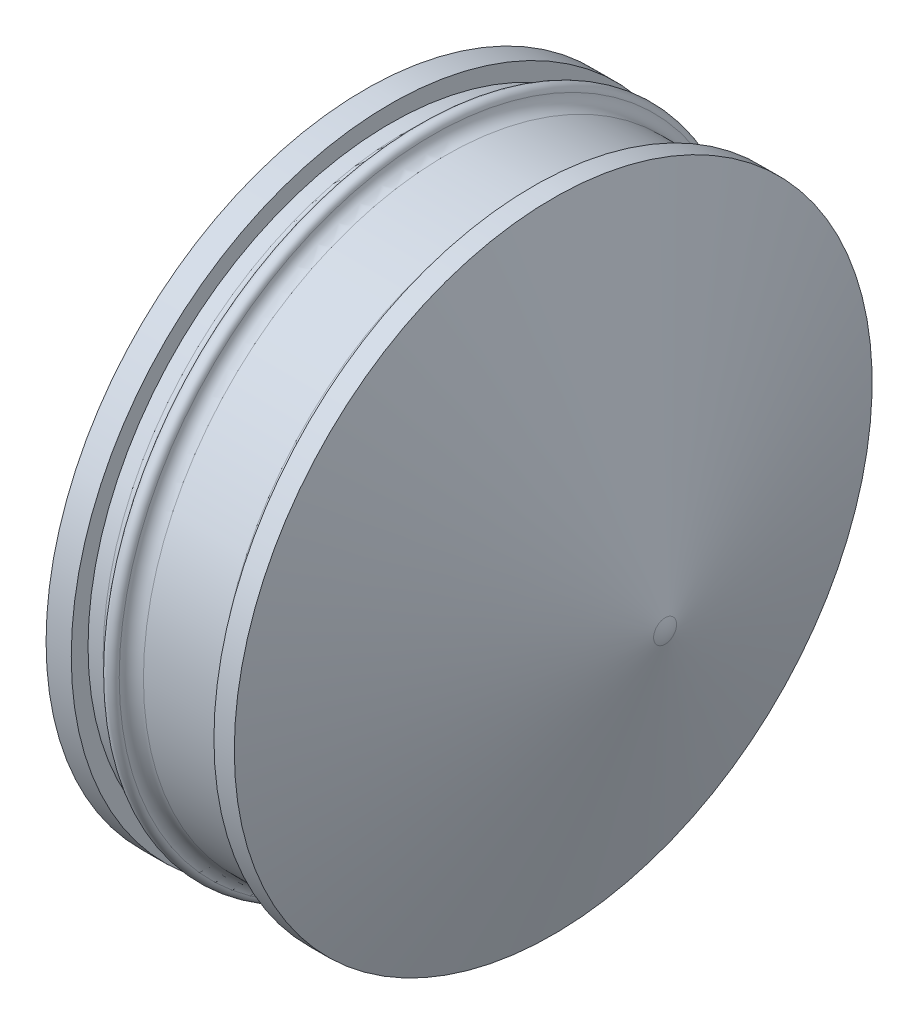
ISO-10303-21;
HEADER;
FILE_DESCRIPTION(('STEP AP214'),'2;1');
FILE_NAME('part.step','',(''),(''),'','','');
FILE_SCHEMA(('AUTOMOTIVE_DESIGN { 1 0 10303 214 1 1 1 1 }'));
ENDSEC;
DATA;
#1=APPLICATION_CONTEXT('core data for automotive mechanical design processes');
#2=APPLICATION_PROTOCOL_DEFINITION('international standard','automotive_design',2000,#1);
#3=PRODUCT_CONTEXT('',#1,'mechanical');
#4=PRODUCT('Part','Part','',(#3));
#5=PRODUCT_RELATED_PRODUCT_CATEGORY('part','',(#4));
#6=PRODUCT_DEFINITION_FORMATION('','',#4);
#7=PRODUCT_DEFINITION_CONTEXT('part definition',#1,'design');
#8=PRODUCT_DEFINITION('design','',#6,#7);
#9=PRODUCT_DEFINITION_SHAPE('','',#8);
#10=(LENGTH_UNIT() NAMED_UNIT(*) SI_UNIT(.MILLI.,.METRE.));
#11=(NAMED_UNIT(*) PLANE_ANGLE_UNIT() SI_UNIT($,.RADIAN.));
#12=(NAMED_UNIT(*) SI_UNIT($,.STERADIAN.) SOLID_ANGLE_UNIT());
#13=UNCERTAINTY_MEASURE_WITH_UNIT(LENGTH_MEASURE(1.E-05),#10,'distance_accuracy_value','');
#14=(GEOMETRIC_REPRESENTATION_CONTEXT(3) GLOBAL_UNCERTAINTY_ASSIGNED_CONTEXT((#13)) GLOBAL_UNIT_ASSIGNED_CONTEXT((#10,
#11,#12)) REPRESENTATION_CONTEXT('',''));
#15=CARTESIAN_POINT('',(0.,0.,0.));
#16=DIRECTION('',(0.,0.,1.));
#17=DIRECTION('',(1.,0.,0.));
#18=AXIS2_PLACEMENT_3D('',#15,#16,#17);
#19=CARTESIAN_POINT('',(-0.699583002099213,0.,0.));
#20=DIRECTION('',(-1.,0.,0.));
#21=DIRECTION('',(0.,0.,1.));
#22=AXIS2_PLACEMENT_3D('',#19,#20,#21);
#23=CYLINDRICAL_SURFACE('',#22,11.43);
#24=CARTESIAN_POINT('',(0.9525,0.,0.));
#25=DIRECTION('',(-1.,0.,0.));
#26=DIRECTION('',(0.,0.,1.));
#27=AXIS2_PLACEMENT_3D('',#24,#25,#26);
#28=CIRCLE('',#27,11.43);
#29=CARTESIAN_POINT('',(0.9525,0.,11.43));
#30=VERTEX_POINT('',#29);
#31=EDGE_CURVE('E11',#30,#30,#28,.T.);
#32=ORIENTED_EDGE('',*,*,#31,.F.);
#33=EDGE_LOOP('',(#32));
#34=FACE_BOUND('',#33,.T.);
#35=CARTESIAN_POINT('',(1.524,0.,0.));
#36=DIRECTION('',(-1.,0.,0.));
#37=DIRECTION('',(0.,0.,1.));
#38=AXIS2_PLACEMENT_3D('',#35,#36,#37);
#39=CIRCLE('',#38,11.43);
#40=CARTESIAN_POINT('',(1.524,0.,11.43));
#41=VERTEX_POINT('',#40);
#42=EDGE_CURVE('E69',#41,#41,#39,.T.);
#43=ORIENTED_EDGE('',*,*,#42,.T.);
#44=EDGE_LOOP('',(#43));
#45=FACE_BOUND('',#44,.T.);
#46=ADVANCED_FACE('F32',(#34,#45),#23,.T.);
#47=CARTESIAN_POINT('',(0.9525,12.065,0.));
#48=DIRECTION('',(-1.,0.,0.));
#49=DIRECTION('',(0.,0.,1.));
#50=AXIS2_PLACEMENT_3D('',#47,#48,#49);
#51=PLANE('',#50);
#52=CARTESIAN_POINT('',(0.9525,0.,0.));
#53=DIRECTION('',(-1.,0.,0.));
#54=DIRECTION('',(0.,0.,1.));
#55=AXIS2_PLACEMENT_3D('',#52,#53,#54);
#56=CIRCLE('',#55,12.065);
#57=CARTESIAN_POINT('',(0.9525,0.,12.065));
#58=VERTEX_POINT('',#57);
#59=EDGE_CURVE('E38',#58,#58,#56,.T.);
#60=ORIENTED_EDGE('',*,*,#59,.F.);
#61=EDGE_LOOP('',(#60));
#62=FACE_BOUND('',#61,.T.);
#63=ORIENTED_EDGE('',*,*,#31,.T.);
#64=EDGE_LOOP('',(#63));
#65=FACE_BOUND('',#64,.T.);
#66=ADVANCED_FACE('F58',(#62,#65),#51,.F.);
#67=CARTESIAN_POINT('',(-0.699583002099213,0.,0.));
#68=DIRECTION('',(-1.,0.,0.));
#69=DIRECTION('',(0.,0.,1.));
#70=AXIS2_PLACEMENT_3D('',#67,#68,#69);
#71=CYLINDRICAL_SURFACE('',#70,12.065);
#72=CARTESIAN_POINT('',(0.,0.,0.));
#73=DIRECTION('',(-1.,0.,0.));
#74=DIRECTION('',(0.,0.,1.));
#75=AXIS2_PLACEMENT_3D('',#72,#73,#74);
#76=CIRCLE('',#75,12.065);
#77=CARTESIAN_POINT('',(0.,0.,12.065));
#78=VERTEX_POINT('',#77);
#79=EDGE_CURVE('E102',#78,#78,#76,.T.);
#80=ORIENTED_EDGE('',*,*,#79,.F.);
#81=EDGE_LOOP('',(#80));
#82=FACE_BOUND('',#81,.T.);
#83=ORIENTED_EDGE('',*,*,#59,.T.);
#84=EDGE_LOOP('',(#83));
#85=FACE_BOUND('',#84,.T.);
#86=ADVANCED_FACE('F63',(#82,#85),#71,.T.);
#87=CARTESIAN_POINT('',(0.,12.065,0.));
#88=DIRECTION('',(1.,0.,0.));
#89=DIRECTION('',(0.,0.,-1.));
#90=AXIS2_PLACEMENT_3D('',#87,#88,#89);
#91=PLANE('',#90);
#92=CARTESIAN_POINT('',(0.,0.,0.));
#93=DIRECTION('',(-1.,0.,0.));
#94=DIRECTION('',(0.,0.,1.));
#95=AXIS2_PLACEMENT_3D('',#92,#93,#94);
#96=CIRCLE('',#95,7.62);
#97=CARTESIAN_POINT('',(0.,0.,7.62));
#98=VERTEX_POINT('',#97);
#99=EDGE_CURVE('E165',#98,#98,#96,.T.);
#100=ORIENTED_EDGE('',*,*,#99,.F.);
#101=EDGE_LOOP('',(#100));
#102=FACE_BOUND('',#101,.T.);
#103=ORIENTED_EDGE('',*,*,#79,.T.);
#104=EDGE_LOOP('',(#103));
#105=FACE_BOUND('',#104,.T.);
#106=ADVANCED_FACE('F109',(#102,#105),#91,.F.);
#107=CARTESIAN_POINT('',(10.16,0.,0.));
#108=DIRECTION('',(-1.,0.,0.));
#109=DIRECTION('',(0.,1.,0.));
#110=AXIS2_PLACEMENT_3D('',#107,#108,#109);
#111=SPHERICAL_SURFACE('',#110,1.27);
#112=CARTESIAN_POINT('',(11.3534096283981,0.,0.));
#113=DIRECTION('',(-1.,0.,0.));
#114=DIRECTION('',(0.,0.,1.));
#115=AXIS2_PLACEMENT_3D('',#112,#113,#114);
#116=CIRCLE('',#115,0.434365582023598);
#117=CARTESIAN_POINT('',(11.3534096283981,0.,0.434365582023598));
#118=VERTEX_POINT('',#117);
#119=EDGE_CURVE('E99',#118,#118,#116,.T.);
#120=ORIENTED_EDGE('',*,*,#119,.F.);
#121=EDGE_LOOP('',(#120));
#122=FACE_BOUND('',#121,.T.);
#123=ADVANCED_FACE('F115',(#122),#111,.T.);
#124=CARTESIAN_POINT('',(11.3534096283981,0.,0.));
#125=DIRECTION('',(-1.,0.,0.));
#126=DIRECTION('',(0.,0.,1.));
#127=AXIS2_PLACEMENT_3D('',#124,#125,#126);
#128=CONICAL_SURFACE('',#127,0.434365582023598,1.22173047639603);
#129=CARTESIAN_POINT('',(7.12020489462271,0.,0.));
#130=DIRECTION('',(-1.,0.,0.));
#131=DIRECTION('',(0.,0.,1.));
#132=AXIS2_PLACEMENT_3D('',#129,#130,#131);
#133=CIRCLE('',#132,12.065);
#134=CARTESIAN_POINT('',(7.12020489462271,0.,12.065));
#135=VERTEX_POINT('',#134);
#136=EDGE_CURVE('E96',#135,#135,#133,.T.);
#137=ORIENTED_EDGE('',*,*,#136,.F.);
#138=EDGE_LOOP('',(#137));
#139=FACE_BOUND('',#138,.T.);
#140=ORIENTED_EDGE('',*,*,#119,.T.);
#141=EDGE_LOOP('',(#140));
#142=FACE_BOUND('',#141,.T.);
#143=ADVANCED_FACE('F122',(#139,#142),#128,.T.);
#144=CARTESIAN_POINT('',(-0.699583002099213,0.,0.));
#145=DIRECTION('',(-1.,0.,0.));
#146=DIRECTION('',(0.,0.,1.));
#147=AXIS2_PLACEMENT_3D('',#144,#145,#146);
#148=CYLINDRICAL_SURFACE('',#147,12.065);
#149=CARTESIAN_POINT('',(6.35,0.,0.));
#150=DIRECTION('',(-1.,0.,0.));
#151=DIRECTION('',(0.,0.,1.));
#152=AXIS2_PLACEMENT_3D('',#149,#150,#151);
#153=CIRCLE('',#152,12.065);
#154=CARTESIAN_POINT('',(6.35,0.,12.065));
#155=VERTEX_POINT('',#154);
#156=EDGE_CURVE('E93',#155,#155,#153,.T.);
#157=ORIENTED_EDGE('',*,*,#156,.F.);
#158=EDGE_LOOP('',(#157));
#159=FACE_BOUND('',#158,.T.);
#160=ORIENTED_EDGE('',*,*,#136,.T.);
#161=EDGE_LOOP('',(#160));
#162=FACE_BOUND('',#161,.T.);
#163=ADVANCED_FACE('F126',(#159,#162),#148,.T.);
#164=CARTESIAN_POINT('',(6.35,11.938,0.));
#165=DIRECTION('',(1.,0.,0.));
#166=DIRECTION('',(0.,0.,-1.));
#167=AXIS2_PLACEMENT_3D('',#164,#165,#166);
#168=PLANE('',#167);
#169=CARTESIAN_POINT('',(6.35,0.,0.));
#170=DIRECTION('',(-1.,0.,0.));
#171=DIRECTION('',(0.,0.,1.));
#172=AXIS2_PLACEMENT_3D('',#169,#170,#171);
#173=CIRCLE('',#172,11.938);
#174=CARTESIAN_POINT('',(6.35,0.,11.938));
#175=VERTEX_POINT('',#174);
#176=EDGE_CURVE('E90',#175,#175,#173,.T.);
#177=ORIENTED_EDGE('',*,*,#176,.F.);
#178=EDGE_LOOP('',(#177));
#179=FACE_BOUND('',#178,.T.);
#180=ORIENTED_EDGE('',*,*,#156,.T.);
#181=EDGE_LOOP('',(#180));
#182=FACE_BOUND('',#181,.T.);
#183=ADVANCED_FACE('F130',(#179,#182),#168,.F.);
#184=CARTESIAN_POINT('',(5.842,0.,0.));
#185=DIRECTION('',(-1.,0.,0.));
#186=DIRECTION('',(0.,0.,1.));
#187=AXIS2_PLACEMENT_3D('',#184,#185,#186);
#188=TOROIDAL_SURFACE('',#187,11.938,0.508);
#189=CARTESIAN_POINT('',(5.842,0.,0.));
#190=DIRECTION('',(-1.,0.,0.));
#191=DIRECTION('',(0.,0.,1.));
#192=AXIS2_PLACEMENT_3D('',#189,#190,#191);
#193=CIRCLE('',#192,11.43);
#194=CARTESIAN_POINT('',(5.842,0.,11.43));
#195=VERTEX_POINT('',#194);
#196=EDGE_CURVE('E87',#195,#195,#193,.T.);
#197=ORIENTED_EDGE('',*,*,#196,.F.);
#198=EDGE_LOOP('',(#197));
#199=FACE_BOUND('',#198,.T.);
#200=ORIENTED_EDGE('',*,*,#176,.T.);
#201=EDGE_LOOP('',(#200));
#202=FACE_BOUND('',#201,.T.);
#203=ADVANCED_FACE('F134',(#199,#202),#188,.F.);
#204=CARTESIAN_POINT('',(-0.699583002099213,0.,0.));
#205=DIRECTION('',(-1.,0.,0.));
#206=DIRECTION('',(0.,0.,1.));
#207=AXIS2_PLACEMENT_3D('',#204,#205,#206);
#208=CYLINDRICAL_SURFACE('',#207,11.43);
#209=CARTESIAN_POINT('',(3.048,0.,0.));
#210=DIRECTION('',(-1.,0.,0.));
#211=DIRECTION('',(0.,0.,1.));
#212=AXIS2_PLACEMENT_3D('',#209,#210,#211);
#213=CIRCLE('',#212,11.43);
#214=CARTESIAN_POINT('',(3.048,0.,11.43));
#215=VERTEX_POINT('',#214);
#216=EDGE_CURVE('E84',#215,#215,#213,.T.);
#217=ORIENTED_EDGE('',*,*,#216,.F.);
#218=EDGE_LOOP('',(#217));
#219=FACE_BOUND('',#218,.T.);
#220=ORIENTED_EDGE('',*,*,#196,.T.);
#221=EDGE_LOOP('',(#220));
#222=FACE_BOUND('',#221,.T.);
#223=ADVANCED_FACE('F138',(#219,#222),#208,.T.);
#224=CARTESIAN_POINT('',(3.048,0.,0.));
#225=DIRECTION('',(-1.,0.,0.));
#226=DIRECTION('',(0.,0.,1.));
#227=AXIS2_PLACEMENT_3D('',#224,#225,#226);
#228=TOROIDAL_SURFACE('',#227,11.938,0.507999999999999);
#229=CARTESIAN_POINT('',(2.54832786885246,0.,0.));
#230=DIRECTION('',(-1.,0.,0.));
#231=DIRECTION('',(0.,0.,1.));
#232=AXIS2_PLACEMENT_3D('',#229,#230,#231);
#233=CIRCLE('',#232,11.8463934426229);
#234=CARTESIAN_POINT('',(2.54832786885246,0.,11.8463934426229));
#235=VERTEX_POINT('',#234);
#236=EDGE_CURVE('E75',#235,#235,#233,.T.);
#237=ORIENTED_EDGE('',*,*,#236,.F.);
#238=EDGE_LOOP('',(#237));
#239=FACE_BOUND('',#238,.T.);
#240=ORIENTED_EDGE('',*,*,#216,.T.);
#241=EDGE_LOOP('',(#240));
#242=FACE_BOUND('',#241,.T.);
#243=ADVANCED_FACE('F142',(#239,#242),#228,.F.);
#244=CARTESIAN_POINT('',(2.286,0.,0.));
#245=DIRECTION('',(-1.,0.,0.));
#246=DIRECTION('',(0.,0.,1.));
#247=AXIS2_PLACEMENT_3D('',#244,#245,#246);
#248=TOROIDAL_SURFACE('',#247,11.7983,0.2667);
#249=CARTESIAN_POINT('',(2.02367213114754,0.,0.));
#250=DIRECTION('',(-1.,0.,0.));
#251=DIRECTION('',(0.,0.,1.));
#252=AXIS2_PLACEMENT_3D('',#249,#250,#251);
#253=CIRCLE('',#252,11.8463934426229);
#254=CARTESIAN_POINT('',(2.02367213114754,0.,11.8463934426229));
#255=VERTEX_POINT('',#254);
#256=EDGE_CURVE('E71',#255,#255,#253,.T.);
#257=ORIENTED_EDGE('',*,*,#256,.F.);
#258=EDGE_LOOP('',(#257));
#259=FACE_BOUND('',#258,.T.);
#260=ORIENTED_EDGE('',*,*,#236,.T.);
#261=EDGE_LOOP('',(#260));
#262=FACE_BOUND('',#261,.T.);
#263=ADVANCED_FACE('F146',(#259,#262),#248,.T.);
#264=CARTESIAN_POINT('',(1.524,0.,0.));
#265=DIRECTION('',(-1.,0.,0.));
#266=DIRECTION('',(0.,0.,1.));
#267=AXIS2_PLACEMENT_3D('',#264,#265,#266);
#268=TOROIDAL_SURFACE('',#267,11.938,0.507999999999999);
#269=ORIENTED_EDGE('',*,*,#42,.F.);
#270=EDGE_LOOP('',(#269));
#271=FACE_BOUND('',#270,.T.);
#272=ORIENTED_EDGE('',*,*,#256,.T.);
#273=EDGE_LOOP('',(#272));
#274=FACE_BOUND('',#273,.T.);
#275=ADVANCED_FACE('F150',(#271,#274),#268,.F.);
#276=CARTESIAN_POINT('',(2.0955,7.62,0.));
#277=DIRECTION('',(1.,0.,0.));
#278=DIRECTION('',(0.,0.,-1.));
#279=AXIS2_PLACEMENT_3D('',#276,#277,#278);
#280=PLANE('',#279);
#281=CARTESIAN_POINT('',(2.0955,0.,0.));
#282=DIRECTION('',(-1.,0.,0.));
#283=DIRECTION('',(0.,0.,1.));
#284=AXIS2_PLACEMENT_3D('',#281,#282,#283);
#285=CIRCLE('',#284,7.62);
#286=CARTESIAN_POINT('',(2.0955,0.,7.62));
#287=VERTEX_POINT('',#286);
#288=EDGE_CURVE('E161',#287,#287,#285,.T.);
#289=ORIENTED_EDGE('',*,*,#288,.T.);
#290=EDGE_LOOP('',(#289));
#291=FACE_BOUND('',#290,.T.);
#292=CARTESIAN_POINT('',(2.0955,0.,0.));
#293=DIRECTION('',(-1.,0.,0.));
#294=DIRECTION('',(0.,0.,1.));
#295=AXIS2_PLACEMENT_3D('',#292,#293,#294);
#296=CIRCLE('',#295,11.303);
#297=CARTESIAN_POINT('',(2.0955,0.,11.303));
#298=VERTEX_POINT('',#297);
#299=EDGE_CURVE('E72',#298,#298,#296,.T.);
#300=ORIENTED_EDGE('',*,*,#299,.F.);
#301=EDGE_LOOP('',(#300));
#302=FACE_BOUND('',#301,.T.);
#303=ADVANCED_FACE('F53',(#291,#302),#280,.T.);
#304=CARTESIAN_POINT('',(-1.46992514195673,0.,0.));
#305=DIRECTION('',(-1.,0.,0.));
#306=DIRECTION('',(0.,0.,1.));
#307=AXIS2_PLACEMENT_3D('',#304,#305,#306);
#308=CYLINDRICAL_SURFACE('',#307,11.303);
#309=ORIENTED_EDGE('',*,*,#299,.T.);
#310=EDGE_LOOP('',(#309));
#311=FACE_BOUND('',#310,.T.);
#312=CARTESIAN_POINT('',(5.77574328788027,0.,0.));
#313=DIRECTION('',(-1.,0.,0.));
#314=DIRECTION('',(0.,0.,1.));
#315=AXIS2_PLACEMENT_3D('',#312,#313,#314);
#316=CIRCLE('',#315,11.303);
#317=CARTESIAN_POINT('',(5.77574328788027,0.,11.303));
#318=VERTEX_POINT('',#317);
#319=EDGE_CURVE('E78',#318,#318,#316,.T.);
#320=ORIENTED_EDGE('',*,*,#319,.F.);
#321=EDGE_LOOP('',(#320));
#322=FACE_BOUND('',#321,.T.);
#323=ADVANCED_FACE('F44',(#311,#322),#308,.F.);
#324=CARTESIAN_POINT('',(9.88969884579112,0.,0.));
#325=DIRECTION('',(-1.,0.,0.));
#326=DIRECTION('',(0.,0.,1.));
#327=AXIS2_PLACEMENT_3D('',#324,#325,#326);
#328=CONICAL_SURFACE('',#327,0.,1.22173047639603);
#329=ORIENTED_EDGE('',*,*,#319,.T.);
#330=EDGE_LOOP('',(#329));
#331=FACE_BOUND('',#330,.T.);
#332=CARTESIAN_POINT('',(9.88969884579112,0.,0.));
#333=VERTEX_POINT('',#332);
#334=VERTEX_LOOP('',#333);
#335=FACE_BOUND('',#334,.T.);
#336=ADVANCED_FACE('F41',(#331,#335),#328,.F.);
#337=CARTESIAN_POINT('',(-1.46992514195673,0.,0.));
#338=DIRECTION('',(-1.,0.,0.));
#339=DIRECTION('',(0.,0.,1.));
#340=AXIS2_PLACEMENT_3D('',#337,#338,#339);
#341=CYLINDRICAL_SURFACE('',#340,7.62);
#342=ORIENTED_EDGE('',*,*,#99,.T.);
#343=EDGE_LOOP('',(#342));
#344=FACE_BOUND('',#343,.T.);
#345=ORIENTED_EDGE('',*,*,#288,.F.);
#346=EDGE_LOOP('',(#345));
#347=FACE_BOUND('',#346,.T.);
#348=ADVANCED_FACE('F43',(#344,#347),#341,.F.);
#349=CLOSED_SHELL('',(#46,#66,#86,#106,#123,#143,#163,#183,#203,#223,#243,#263,#275,#303,#323,
#336,#348));
#350=MANIFOLD_SOLID_BREP('B2',#349);
#351=ADVANCED_BREP_SHAPE_REPRESENTATION('',(#18,#350),#14);
#352=SHAPE_DEFINITION_REPRESENTATION(#9,#351);
ENDSEC;
END-ISO-10303-21;
